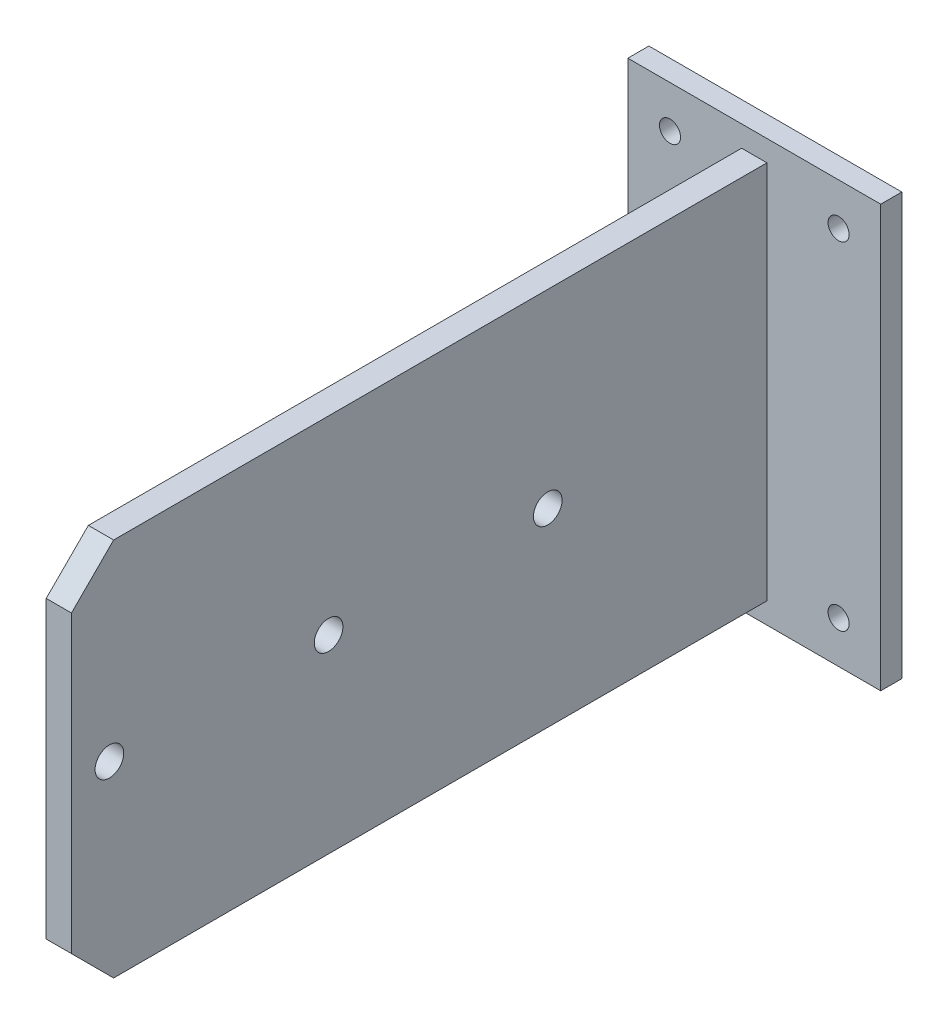
ISO-10303-21;
HEADER;
FILE_DESCRIPTION(('STEP AP214'),'2;1');
FILE_NAME('part.step','',(''),(''),'','','');
FILE_SCHEMA(('AUTOMOTIVE_DESIGN { 1 0 10303 214 1 1 1 1 }'));
ENDSEC;
DATA;
#1=APPLICATION_CONTEXT('core data for automotive mechanical design processes');
#2=APPLICATION_PROTOCOL_DEFINITION('international standard','automotive_design',2000,#1);
#3=PRODUCT_CONTEXT('',#1,'mechanical');
#4=PRODUCT('Part','Part','',(#3));
#5=PRODUCT_RELATED_PRODUCT_CATEGORY('part','',(#4));
#6=PRODUCT_DEFINITION_FORMATION('','',#4);
#7=PRODUCT_DEFINITION_CONTEXT('part definition',#1,'design');
#8=PRODUCT_DEFINITION('design','',#6,#7);
#9=PRODUCT_DEFINITION_SHAPE('','',#8);
#10=(LENGTH_UNIT() NAMED_UNIT(*) SI_UNIT(.MILLI.,.METRE.));
#11=(NAMED_UNIT(*) PLANE_ANGLE_UNIT() SI_UNIT($,.RADIAN.));
#12=(NAMED_UNIT(*) SI_UNIT($,.STERADIAN.) SOLID_ANGLE_UNIT());
#13=UNCERTAINTY_MEASURE_WITH_UNIT(LENGTH_MEASURE(1.E-05),#10,'distance_accuracy_value','');
#14=(GEOMETRIC_REPRESENTATION_CONTEXT(3) GLOBAL_UNCERTAINTY_ASSIGNED_CONTEXT((#13)) GLOBAL_UNIT_ASSIGNED_CONTEXT((#10,
#11,#12)) REPRESENTATION_CONTEXT('',''));
#15=CARTESIAN_POINT('',(0.,0.,0.));
#16=DIRECTION('',(0.,0.,1.));
#17=DIRECTION('',(1.,0.,0.));
#18=AXIS2_PLACEMENT_3D('',#15,#16,#17);
#19=CARTESIAN_POINT('',(0.,0.,5.));
#20=DIRECTION('',(0.,0.,-1.));
#21=DIRECTION('',(-1.,0.,0.));
#22=AXIS2_PLACEMENT_3D('',#19,#20,#21);
#23=PLANE('',#22);
#24=CARTESIAN_POINT('',(-20.,-40.,5.));
#25=DIRECTION('',(0.,0.,1.));
#26=DIRECTION('',(-1.,0.,0.));
#27=AXIS2_PLACEMENT_3D('',#24,#25,#26);
#28=CIRCLE('',#27,2.5);
#29=CARTESIAN_POINT('',(-22.5,-40.,5.));
#30=VERTEX_POINT('',#29);
#31=EDGE_CURVE('E155',#30,#30,#28,.T.);
#32=ORIENTED_EDGE('',*,*,#31,.F.);
#33=EDGE_LOOP('',(#32));
#34=FACE_BOUND('',#33,.T.);
#35=CARTESIAN_POINT('',(20.,-40.,5.));
#36=DIRECTION('',(0.,0.,1.));
#37=DIRECTION('',(1.,0.,0.));
#38=AXIS2_PLACEMENT_3D('',#35,#36,#37);
#39=CIRCLE('',#38,2.5);
#40=CARTESIAN_POINT('',(22.5,-40.,5.));
#41=VERTEX_POINT('',#40);
#42=EDGE_CURVE('E161',#41,#41,#39,.T.);
#43=ORIENTED_EDGE('',*,*,#42,.F.);
#44=EDGE_LOOP('',(#43));
#45=FACE_BOUND('',#44,.T.);
#46=CARTESIAN_POINT('',(20.,40.,5.));
#47=DIRECTION('',(0.,0.,1.));
#48=DIRECTION('',(-1.,0.,0.));
#49=AXIS2_PLACEMENT_3D('',#46,#47,#48);
#50=CIRCLE('',#49,2.5);
#51=CARTESIAN_POINT('',(17.5,40.,5.));
#52=VERTEX_POINT('',#51);
#53=EDGE_CURVE('E167',#52,#52,#50,.T.);
#54=ORIENTED_EDGE('',*,*,#53,.F.);
#55=EDGE_LOOP('',(#54));
#56=FACE_BOUND('',#55,.T.);
#57=CARTESIAN_POINT('',(-20.,40.,5.));
#58=DIRECTION('',(0.,0.,1.));
#59=DIRECTION('',(1.,0.,0.));
#60=AXIS2_PLACEMENT_3D('',#57,#58,#59);
#61=CIRCLE('',#60,2.5);
#62=CARTESIAN_POINT('',(-17.5,40.,5.));
#63=VERTEX_POINT('',#62);
#64=EDGE_CURVE('E173',#63,#63,#61,.T.);
#65=ORIENTED_EDGE('',*,*,#64,.F.);
#66=EDGE_LOOP('',(#65));
#67=FACE_BOUND('',#66,.T.);
#68=DIRECTION('',(0.,1.,0.));
#69=VECTOR('',#68,1.);
#70=CARTESIAN_POINT('',(30.,-50.,5.));
#71=LINE('',#70,#69);
#72=CARTESIAN_POINT('',(30.,-50.,5.));
#73=VERTEX_POINT('',#72);
#74=CARTESIAN_POINT('',(30.,50.,5.));
#75=VERTEX_POINT('',#74);
#76=EDGE_CURVE('E179',#73,#75,#71,.T.);
#77=ORIENTED_EDGE('',*,*,#76,.T.);
#78=DIRECTION('',(-1.,0.,0.));
#79=VECTOR('',#78,1.);
#80=CARTESIAN_POINT('',(-30.,50.,5.));
#81=LINE('',#80,#79);
#82=CARTESIAN_POINT('',(-30.,50.,5.));
#83=VERTEX_POINT('',#82);
#84=EDGE_CURVE('E182',#75,#83,#81,.T.);
#85=ORIENTED_EDGE('',*,*,#84,.T.);
#86=DIRECTION('',(0.,-1.,0.));
#87=VECTOR('',#86,1.);
#88=CARTESIAN_POINT('',(-30.,-50.,5.));
#89=LINE('',#88,#87);
#90=CARTESIAN_POINT('',(-30.,-50.,5.));
#91=VERTEX_POINT('',#90);
#92=EDGE_CURVE('E185',#83,#91,#89,.T.);
#93=ORIENTED_EDGE('',*,*,#92,.T.);
#94=DIRECTION('',(1.,0.,0.));
#95=VECTOR('',#94,1.);
#96=CARTESIAN_POINT('',(-30.,-50.,5.));
#97=LINE('',#96,#95);
#98=EDGE_CURVE('E187',#91,#73,#97,.T.);
#99=ORIENTED_EDGE('',*,*,#98,.T.);
#100=EDGE_LOOP('',(#77,#85,#93,#99));
#101=FACE_BOUND('',#100,.T.);
#102=DIRECTION('',(1.,0.,0.));
#103=VECTOR('',#102,1.);
#104=CARTESIAN_POINT('',(0.,-45.,5.));
#105=LINE('',#104,#103);
#106=CARTESIAN_POINT('',(-3.,-45.,5.));
#107=VERTEX_POINT('',#106);
#108=CARTESIAN_POINT('',(3.,-45.,5.));
#109=VERTEX_POINT('',#108);
#110=EDGE_CURVE('E133',#107,#109,#105,.T.);
#111=ORIENTED_EDGE('',*,*,#110,.F.);
#112=DIRECTION('',(0.,1.,0.));
#113=VECTOR('',#112,1.);
#114=CARTESIAN_POINT('',(-3.,0.,5.));
#115=LINE('',#114,#113);
#116=CARTESIAN_POINT('',(-3.,45.,5.));
#117=VERTEX_POINT('',#116);
#118=EDGE_CURVE('E144',#107,#117,#115,.T.);
#119=ORIENTED_EDGE('',*,*,#118,.T.);
#120=DIRECTION('',(1.,0.,0.));
#121=VECTOR('',#120,1.);
#122=CARTESIAN_POINT('',(0.,45.,5.));
#123=LINE('',#122,#121);
#124=CARTESIAN_POINT('',(3.,45.,5.));
#125=VERTEX_POINT('',#124);
#126=EDGE_CURVE('E142',#117,#125,#123,.T.);
#127=ORIENTED_EDGE('',*,*,#126,.T.);
#128=DIRECTION('',(0.,1.,0.));
#129=VECTOR('',#128,1.);
#130=CARTESIAN_POINT('',(3.,0.,5.));
#131=LINE('',#130,#129);
#132=EDGE_CURVE('E126',#109,#125,#131,.T.);
#133=ORIENTED_EDGE('',*,*,#132,.F.);
#134=EDGE_LOOP('',(#111,#119,#127,#133));
#135=FACE_BOUND('',#134,.T.);
#136=ADVANCED_FACE('F41',(#34,#45,#56,#67,#101,#135),#23,.F.);
#137=CARTESIAN_POINT('',(0.,0.,0.));
#138=DIRECTION('',(0.,0.,-1.));
#139=DIRECTION('',(-1.,0.,0.));
#140=AXIS2_PLACEMENT_3D('',#137,#138,#139);
#141=PLANE('',#140);
#142=CARTESIAN_POINT('',(20.,-40.,0.));
#143=DIRECTION('',(0.,0.,1.));
#144=DIRECTION('',(1.,0.,0.));
#145=AXIS2_PLACEMENT_3D('',#142,#143,#144);
#146=CIRCLE('',#145,2.5);
#147=CARTESIAN_POINT('',(22.5,-40.,0.));
#148=VERTEX_POINT('',#147);
#149=EDGE_CURVE('E158',#148,#148,#146,.T.);
#150=ORIENTED_EDGE('',*,*,#149,.T.);
#151=EDGE_LOOP('',(#150));
#152=FACE_BOUND('',#151,.T.);
#153=CARTESIAN_POINT('',(-20.,40.,0.));
#154=DIRECTION('',(0.,0.,1.));
#155=DIRECTION('',(1.,0.,0.));
#156=AXIS2_PLACEMENT_3D('',#153,#154,#155);
#157=CIRCLE('',#156,2.5);
#158=CARTESIAN_POINT('',(-17.5,40.,0.));
#159=VERTEX_POINT('',#158);
#160=EDGE_CURVE('E170',#159,#159,#157,.T.);
#161=ORIENTED_EDGE('',*,*,#160,.T.);
#162=EDGE_LOOP('',(#161));
#163=FACE_BOUND('',#162,.T.);
#164=DIRECTION('',(0.,1.,0.));
#165=VECTOR('',#164,1.);
#166=CARTESIAN_POINT('',(30.,-50.,0.));
#167=LINE('',#166,#165);
#168=CARTESIAN_POINT('',(30.,-50.,0.));
#169=VERTEX_POINT('',#168);
#170=CARTESIAN_POINT('',(30.,50.,0.));
#171=VERTEX_POINT('',#170);
#172=EDGE_CURVE('E176',#169,#171,#167,.T.);
#173=ORIENTED_EDGE('',*,*,#172,.F.);
#174=DIRECTION('',(1.,0.,0.));
#175=VECTOR('',#174,1.);
#176=CARTESIAN_POINT('',(-30.,-50.,0.));
#177=LINE('',#176,#175);
#178=CARTESIAN_POINT('',(-30.,-50.,0.));
#179=VERTEX_POINT('',#178);
#180=EDGE_CURVE('E183',#179,#169,#177,.T.);
#181=ORIENTED_EDGE('',*,*,#180,.F.);
#182=DIRECTION('',(0.,-1.,0.));
#183=VECTOR('',#182,1.);
#184=CARTESIAN_POINT('',(-30.,-50.,0.));
#185=LINE('',#184,#183);
#186=CARTESIAN_POINT('',(-30.,50.,0.));
#187=VERTEX_POINT('',#186);
#188=EDGE_CURVE('E194',#187,#179,#185,.T.);
#189=ORIENTED_EDGE('',*,*,#188,.F.);
#190=DIRECTION('',(-1.,0.,0.));
#191=VECTOR('',#190,1.);
#192=CARTESIAN_POINT('',(-30.,50.,0.));
#193=LINE('',#192,#191);
#194=EDGE_CURVE('E192',#171,#187,#193,.T.);
#195=ORIENTED_EDGE('',*,*,#194,.F.);
#196=EDGE_LOOP('',(#173,#181,#189,#195));
#197=FACE_BOUND('',#196,.T.);
#198=CARTESIAN_POINT('',(20.,40.,0.));
#199=DIRECTION('',(0.,0.,1.));
#200=DIRECTION('',(-1.,0.,0.));
#201=AXIS2_PLACEMENT_3D('',#198,#199,#200);
#202=CIRCLE('',#201,2.5);
#203=CARTESIAN_POINT('',(17.5,40.,0.));
#204=VERTEX_POINT('',#203);
#205=EDGE_CURVE('E164',#204,#204,#202,.T.);
#206=ORIENTED_EDGE('',*,*,#205,.T.);
#207=EDGE_LOOP('',(#206));
#208=FACE_BOUND('',#207,.T.);
#209=CARTESIAN_POINT('',(-20.,-40.,0.));
#210=DIRECTION('',(0.,0.,1.));
#211=DIRECTION('',(-1.,0.,0.));
#212=AXIS2_PLACEMENT_3D('',#209,#210,#211);
#213=CIRCLE('',#212,2.5);
#214=CARTESIAN_POINT('',(-22.5,-40.,0.));
#215=VERTEX_POINT('',#214);
#216=EDGE_CURVE('E129',#215,#215,#213,.T.);
#217=ORIENTED_EDGE('',*,*,#216,.T.);
#218=EDGE_LOOP('',(#217));
#219=FACE_BOUND('',#218,.T.);
#220=ADVANCED_FACE('F238',(#152,#163,#197,#208,#219),#141,.T.);
#221=CARTESIAN_POINT('',(30.,-50.,5.));
#222=DIRECTION('',(-1.,0.,0.));
#223=DIRECTION('',(0.,0.,1.));
#224=AXIS2_PLACEMENT_3D('',#221,#222,#223);
#225=PLANE('',#224);
#226=ORIENTED_EDGE('',*,*,#172,.T.);
#227=DIRECTION('',(0.,0.,-1.));
#228=VECTOR('',#227,1.);
#229=CARTESIAN_POINT('',(30.,50.,5.));
#230=LINE('',#229,#228);
#231=EDGE_CURVE('E205',#75,#171,#230,.T.);
#232=ORIENTED_EDGE('',*,*,#231,.F.);
#233=ORIENTED_EDGE('',*,*,#76,.F.);
#234=DIRECTION('',(0.,0.,-1.));
#235=VECTOR('',#234,1.);
#236=CARTESIAN_POINT('',(30.,-50.,5.));
#237=LINE('',#236,#235);
#238=EDGE_CURVE('E189',#73,#169,#237,.T.);
#239=ORIENTED_EDGE('',*,*,#238,.T.);
#240=EDGE_LOOP('',(#226,#232,#233,#239));
#241=FACE_BOUND('',#240,.T.);
#242=ADVANCED_FACE('F246',(#241),#225,.F.);
#243=CARTESIAN_POINT('',(-30.,50.,5.));
#244=DIRECTION('',(0.,-1.,0.));
#245=DIRECTION('',(0.,0.,-1.));
#246=AXIS2_PLACEMENT_3D('',#243,#244,#245);
#247=PLANE('',#246);
#248=ORIENTED_EDGE('',*,*,#194,.T.);
#249=DIRECTION('',(0.,0.,-1.));
#250=VECTOR('',#249,1.);
#251=CARTESIAN_POINT('',(-30.,50.,5.));
#252=LINE('',#251,#250);
#253=EDGE_CURVE('E202',#83,#187,#252,.T.);
#254=ORIENTED_EDGE('',*,*,#253,.F.);
#255=ORIENTED_EDGE('',*,*,#84,.F.);
#256=ORIENTED_EDGE('',*,*,#231,.T.);
#257=EDGE_LOOP('',(#248,#254,#255,#256));
#258=FACE_BOUND('',#257,.T.);
#259=ADVANCED_FACE('F262',(#258),#247,.F.);
#260=CARTESIAN_POINT('',(-30.,-50.,5.));
#261=DIRECTION('',(1.,0.,0.));
#262=DIRECTION('',(0.,0.,-1.));
#263=AXIS2_PLACEMENT_3D('',#260,#261,#262);
#264=PLANE('',#263);
#265=ORIENTED_EDGE('',*,*,#188,.T.);
#266=DIRECTION('',(0.,0.,-1.));
#267=VECTOR('',#266,1.);
#268=CARTESIAN_POINT('',(-30.,-50.,5.));
#269=LINE('',#268,#267);
#270=EDGE_CURVE('E199',#91,#179,#269,.T.);
#271=ORIENTED_EDGE('',*,*,#270,.F.);
#272=ORIENTED_EDGE('',*,*,#92,.F.);
#273=ORIENTED_EDGE('',*,*,#253,.T.);
#274=EDGE_LOOP('',(#265,#271,#272,#273));
#275=FACE_BOUND('',#274,.T.);
#276=ADVANCED_FACE('F258',(#275),#264,.F.);
#277=CARTESIAN_POINT('',(-30.,-50.,5.));
#278=DIRECTION('',(0.,1.,0.));
#279=DIRECTION('',(0.,0.,1.));
#280=AXIS2_PLACEMENT_3D('',#277,#278,#279);
#281=PLANE('',#280);
#282=ORIENTED_EDGE('',*,*,#180,.T.);
#283=ORIENTED_EDGE('',*,*,#238,.F.);
#284=ORIENTED_EDGE('',*,*,#98,.F.);
#285=ORIENTED_EDGE('',*,*,#270,.T.);
#286=EDGE_LOOP('',(#282,#283,#284,#285));
#287=FACE_BOUND('',#286,.T.);
#288=ADVANCED_FACE('F255',(#287),#281,.F.);
#289=CARTESIAN_POINT('',(-20.,40.,5.));
#290=DIRECTION('',(0.,0.,-1.));
#291=DIRECTION('',(-1.,0.,0.));
#292=AXIS2_PLACEMENT_3D('',#289,#290,#291);
#293=CYLINDRICAL_SURFACE('',#292,2.5);
#294=ORIENTED_EDGE('',*,*,#64,.T.);
#295=EDGE_LOOP('',(#294));
#296=FACE_BOUND('',#295,.T.);
#297=ORIENTED_EDGE('',*,*,#160,.F.);
#298=EDGE_LOOP('',(#297));
#299=FACE_BOUND('',#298,.T.);
#300=ADVANCED_FACE('F252',(#296,#299),#293,.F.);
#301=CARTESIAN_POINT('',(20.,40.,5.));
#302=DIRECTION('',(0.,0.,-1.));
#303=DIRECTION('',(-1.,0.,0.));
#304=AXIS2_PLACEMENT_3D('',#301,#302,#303);
#305=CYLINDRICAL_SURFACE('',#304,2.5);
#306=ORIENTED_EDGE('',*,*,#53,.T.);
#307=EDGE_LOOP('',(#306));
#308=FACE_BOUND('',#307,.T.);
#309=ORIENTED_EDGE('',*,*,#205,.F.);
#310=EDGE_LOOP('',(#309));
#311=FACE_BOUND('',#310,.T.);
#312=ADVANCED_FACE('F295',(#308,#311),#305,.F.);
#313=CARTESIAN_POINT('',(20.,-40.,5.));
#314=DIRECTION('',(0.,0.,-1.));
#315=DIRECTION('',(-1.,0.,0.));
#316=AXIS2_PLACEMENT_3D('',#313,#314,#315);
#317=CYLINDRICAL_SURFACE('',#316,2.5);
#318=ORIENTED_EDGE('',*,*,#42,.T.);
#319=EDGE_LOOP('',(#318));
#320=FACE_BOUND('',#319,.T.);
#321=ORIENTED_EDGE('',*,*,#149,.F.);
#322=EDGE_LOOP('',(#321));
#323=FACE_BOUND('',#322,.T.);
#324=ADVANCED_FACE('F288',(#320,#323),#317,.F.);
#325=CARTESIAN_POINT('',(-20.,-40.,5.));
#326=DIRECTION('',(0.,0.,-1.));
#327=DIRECTION('',(-1.,0.,0.));
#328=AXIS2_PLACEMENT_3D('',#325,#326,#327);
#329=CYLINDRICAL_SURFACE('',#328,2.5);
#330=ORIENTED_EDGE('',*,*,#31,.T.);
#331=EDGE_LOOP('',(#330));
#332=FACE_BOUND('',#331,.T.);
#333=ORIENTED_EDGE('',*,*,#216,.F.);
#334=EDGE_LOOP('',(#333));
#335=FACE_BOUND('',#334,.T.);
#336=ADVANCED_FACE('F287',(#332,#335),#329,.F.);
#337=CARTESIAN_POINT('',(0.,-45.,170.));
#338=DIRECTION('',(0.,1.,0.));
#339=DIRECTION('',(0.,0.,1.));
#340=AXIS2_PLACEMENT_3D('',#337,#338,#339);
#341=PLANE('',#340);
#342=DIRECTION('',(0.,0.,-1.));
#343=VECTOR('',#342,1.);
#344=CARTESIAN_POINT('',(3.,-45.,170.));
#345=LINE('',#344,#343);
#346=CARTESIAN_POINT('',(3.,-45.,160.));
#347=VERTEX_POINT('',#346);
#348=EDGE_CURVE('E120',#347,#109,#345,.T.);
#349=ORIENTED_EDGE('',*,*,#348,.F.);
#350=DIRECTION('',(-1.,0.,0.));
#351=VECTOR('',#350,1.);
#352=CARTESIAN_POINT('',(-3.,-45.,160.));
#353=LINE('',#352,#351);
#354=CARTESIAN_POINT('',(-3.,-45.,160.));
#355=VERTEX_POINT('',#354);
#356=EDGE_CURVE('E65',#347,#355,#353,.T.);
#357=ORIENTED_EDGE('',*,*,#356,.T.);
#358=DIRECTION('',(0.,0.,-1.));
#359=VECTOR('',#358,1.);
#360=CARTESIAN_POINT('',(-3.,-45.,170.));
#361=LINE('',#360,#359);
#362=EDGE_CURVE('E135',#355,#107,#361,.T.);
#363=ORIENTED_EDGE('',*,*,#362,.T.);
#364=ORIENTED_EDGE('',*,*,#110,.T.);
#365=EDGE_LOOP('',(#349,#357,#363,#364));
#366=FACE_BOUND('',#365,.T.);
#367=ADVANCED_FACE('F134',(#366),#341,.F.);
#368=CARTESIAN_POINT('',(3.,0.,170.));
#369=DIRECTION('',(-1.,0.,0.));
#370=DIRECTION('',(0.,0.,1.));
#371=AXIS2_PLACEMENT_3D('',#368,#369,#370);
#372=PLANE('',#371);
#373=CARTESIAN_POINT('',(3.,0.,57.));
#374=DIRECTION('',(-1.,0.,0.));
#375=DIRECTION('',(0.,0.,1.));
#376=AXIS2_PLACEMENT_3D('',#373,#374,#375);
#377=CIRCLE('',#376,3.4);
#378=CARTESIAN_POINT('',(3.,0.,60.4));
#379=VERTEX_POINT('',#378);
#380=EDGE_CURVE('E139',#379,#379,#377,.T.);
#381=ORIENTED_EDGE('',*,*,#380,.T.);
#382=EDGE_LOOP('',(#381));
#383=FACE_BOUND('',#382,.T.);
#384=CARTESIAN_POINT('',(3.,0.,109.));
#385=DIRECTION('',(-1.,0.,0.));
#386=DIRECTION('',(0.,0.,1.));
#387=AXIS2_PLACEMENT_3D('',#384,#385,#386);
#388=CIRCLE('',#387,3.4);
#389=CARTESIAN_POINT('',(3.,0.,112.4));
#390=VERTEX_POINT('',#389);
#391=EDGE_CURVE('E445',#390,#390,#388,.T.);
#392=ORIENTED_EDGE('',*,*,#391,.T.);
#393=EDGE_LOOP('',(#392));
#394=FACE_BOUND('',#393,.T.);
#395=CARTESIAN_POINT('',(3.,0.,161.));
#396=DIRECTION('',(-1.,0.,0.));
#397=DIRECTION('',(0.,0.,1.));
#398=AXIS2_PLACEMENT_3D('',#395,#396,#397);
#399=CIRCLE('',#398,3.4);
#400=CARTESIAN_POINT('',(3.,0.,164.4));
#401=VERTEX_POINT('',#400);
#402=EDGE_CURVE('E448',#401,#401,#399,.T.);
#403=ORIENTED_EDGE('',*,*,#402,.T.);
#404=EDGE_LOOP('',(#403));
#405=FACE_BOUND('',#404,.T.);
#406=DIRECTION('',(0.,1.,0.));
#407=VECTOR('',#406,1.);
#408=CARTESIAN_POINT('',(3.,0.,170.));
#409=LINE('',#408,#407);
#410=CARTESIAN_POINT('',(3.,-35.,170.));
#411=VERTEX_POINT('',#410);
#412=CARTESIAN_POINT('',(3.,35.,170.));
#413=VERTEX_POINT('',#412);
#414=EDGE_CURVE('E149',#411,#413,#409,.T.);
#415=ORIENTED_EDGE('',*,*,#414,.F.);
#416=DIRECTION('',(0.,-0.707106781186547,-0.707106781186549));
#417=VECTOR('',#416,1.);
#418=CARTESIAN_POINT('',(3.,-35.,170.));
#419=LINE('',#418,#417);
#420=EDGE_CURVE('E128',#411,#347,#419,.T.);
#421=ORIENTED_EDGE('',*,*,#420,.T.);
#422=ORIENTED_EDGE('',*,*,#348,.T.);
#423=ORIENTED_EDGE('',*,*,#132,.T.);
#424=DIRECTION('',(0.,0.,-1.));
#425=VECTOR('',#424,1.);
#426=CARTESIAN_POINT('',(3.,45.,170.));
#427=LINE('',#426,#425);
#428=CARTESIAN_POINT('',(3.,45.,160.));
#429=VERTEX_POINT('',#428);
#430=EDGE_CURVE('E130',#429,#125,#427,.T.);
#431=ORIENTED_EDGE('',*,*,#430,.F.);
#432=DIRECTION('',(0.,0.707106781186549,-0.707106781186547));
#433=VECTOR('',#432,1.);
#434=CARTESIAN_POINT('',(3.,45.,160.));
#435=LINE('',#434,#433);
#436=EDGE_CURVE('E213',#429,#413,#435,.F.);
#437=ORIENTED_EDGE('',*,*,#436,.T.);
#438=EDGE_LOOP('',(#415,#421,#422,#423,#431,#437));
#439=FACE_BOUND('',#438,.T.);
#440=ADVANCED_FACE('F123',(#383,#394,#405,#439),#372,.F.);
#441=CARTESIAN_POINT('',(0.,45.,170.));
#442=DIRECTION('',(0.,1.,0.));
#443=DIRECTION('',(0.,0.,1.));
#444=AXIS2_PLACEMENT_3D('',#441,#442,#443);
#445=PLANE('',#444);
#446=DIRECTION('',(0.,0.,-1.));
#447=VECTOR('',#446,1.);
#448=CARTESIAN_POINT('',(-3.,45.,170.));
#449=LINE('',#448,#447);
#450=CARTESIAN_POINT('',(-3.,45.,160.));
#451=VERTEX_POINT('',#450);
#452=EDGE_CURVE('E151',#451,#117,#449,.T.);
#453=ORIENTED_EDGE('',*,*,#452,.F.);
#454=DIRECTION('',(1.,0.,0.));
#455=VECTOR('',#454,1.);
#456=CARTESIAN_POINT('',(0.,45.,160.));
#457=LINE('',#456,#455);
#458=EDGE_CURVE('E11',#451,#429,#457,.T.);
#459=ORIENTED_EDGE('',*,*,#458,.T.);
#460=ORIENTED_EDGE('',*,*,#430,.T.);
#461=ORIENTED_EDGE('',*,*,#126,.F.);
#462=EDGE_LOOP('',(#453,#459,#460,#461));
#463=FACE_BOUND('',#462,.T.);
#464=ADVANCED_FACE('F374',(#463),#445,.T.);
#465=CARTESIAN_POINT('',(-3.,0.,170.));
#466=DIRECTION('',(-1.,0.,0.));
#467=DIRECTION('',(0.,0.,1.));
#468=AXIS2_PLACEMENT_3D('',#465,#466,#467);
#469=PLANE('',#468);
#470=CARTESIAN_POINT('',(-3.,0.,57.));
#471=DIRECTION('',(-1.,0.,0.));
#472=DIRECTION('',(0.,0.,1.));
#473=AXIS2_PLACEMENT_3D('',#470,#471,#472);
#474=CIRCLE('',#473,3.4);
#475=CARTESIAN_POINT('',(-3.,0.,60.4));
#476=VERTEX_POINT('',#475);
#477=EDGE_CURVE('E442',#476,#476,#474,.T.);
#478=ORIENTED_EDGE('',*,*,#477,.F.);
#479=EDGE_LOOP('',(#478));
#480=FACE_BOUND('',#479,.T.);
#481=CARTESIAN_POINT('',(-3.,0.,109.));
#482=DIRECTION('',(-1.,0.,0.));
#483=DIRECTION('',(0.,0.,1.));
#484=AXIS2_PLACEMENT_3D('',#481,#482,#483);
#485=CIRCLE('',#484,3.4);
#486=CARTESIAN_POINT('',(-3.,0.,112.4));
#487=VERTEX_POINT('',#486);
#488=EDGE_CURVE('E458',#487,#487,#485,.T.);
#489=ORIENTED_EDGE('',*,*,#488,.F.);
#490=EDGE_LOOP('',(#489));
#491=FACE_BOUND('',#490,.T.);
#492=CARTESIAN_POINT('',(-3.,0.,161.));
#493=DIRECTION('',(-1.,0.,0.));
#494=DIRECTION('',(0.,0.,1.));
#495=AXIS2_PLACEMENT_3D('',#492,#493,#494);
#496=CIRCLE('',#495,3.4);
#497=CARTESIAN_POINT('',(-3.,0.,164.4));
#498=VERTEX_POINT('',#497);
#499=EDGE_CURVE('E455',#498,#498,#496,.T.);
#500=ORIENTED_EDGE('',*,*,#499,.F.);
#501=EDGE_LOOP('',(#500));
#502=FACE_BOUND('',#501,.T.);
#503=ORIENTED_EDGE('',*,*,#362,.F.);
#504=DIRECTION('',(0.,0.707106781186547,0.707106781186549));
#505=VECTOR('',#504,1.);
#506=CARTESIAN_POINT('',(-3.,-17.5,187.5));
#507=LINE('',#506,#505);
#508=CARTESIAN_POINT('',(-3.,-35.,170.));
#509=VERTEX_POINT('',#508);
#510=EDGE_CURVE('E50',#355,#509,#507,.T.);
#511=ORIENTED_EDGE('',*,*,#510,.T.);
#512=DIRECTION('',(0.,1.,0.));
#513=VECTOR('',#512,1.);
#514=CARTESIAN_POINT('',(-3.,0.,170.));
#515=LINE('',#514,#513);
#516=CARTESIAN_POINT('',(-3.,35.,170.));
#517=VERTEX_POINT('',#516);
#518=EDGE_CURVE('E152',#509,#517,#515,.T.);
#519=ORIENTED_EDGE('',*,*,#518,.T.);
#520=DIRECTION('',(0.,-0.707106781186549,0.707106781186547));
#521=VECTOR('',#520,1.);
#522=CARTESIAN_POINT('',(-3.,17.4999999999999,187.5));
#523=LINE('',#522,#521);
#524=EDGE_CURVE('E57',#517,#451,#523,.F.);
#525=ORIENTED_EDGE('',*,*,#524,.T.);
#526=ORIENTED_EDGE('',*,*,#452,.T.);
#527=ORIENTED_EDGE('',*,*,#118,.F.);
#528=EDGE_LOOP('',(#503,#511,#519,#525,#526,#527));
#529=FACE_BOUND('',#528,.T.);
#530=ADVANCED_FACE('F219',(#480,#491,#502,#529),#469,.T.);
#531=CARTESIAN_POINT('',(0.,0.,170.));
#532=DIRECTION('',(0.,0.,1.));
#533=DIRECTION('',(1.,0.,0.));
#534=AXIS2_PLACEMENT_3D('',#531,#532,#533);
#535=PLANE('',#534);
#536=ORIENTED_EDGE('',*,*,#518,.F.);
#537=DIRECTION('',(1.,0.,0.));
#538=VECTOR('',#537,1.);
#539=CARTESIAN_POINT('',(3.,-35.,170.));
#540=LINE('',#539,#538);
#541=EDGE_CURVE('E210',#509,#411,#540,.T.);
#542=ORIENTED_EDGE('',*,*,#541,.T.);
#543=ORIENTED_EDGE('',*,*,#414,.T.);
#544=DIRECTION('',(-1.,0.,0.));
#545=VECTOR('',#544,1.);
#546=CARTESIAN_POINT('',(0.,35.,170.));
#547=LINE('',#546,#545);
#548=EDGE_CURVE('E208',#413,#517,#547,.T.);
#549=ORIENTED_EDGE('',*,*,#548,.T.);
#550=EDGE_LOOP('',(#536,#542,#543,#549));
#551=FACE_BOUND('',#550,.T.);
#552=ADVANCED_FACE('F223',(#551),#535,.T.);
#553=CARTESIAN_POINT('',(0.,-35.,170.));
#554=DIRECTION('',(0.,-0.707106781186549,0.707106781186547));
#555=DIRECTION('',(-1.,0.,0.));
#556=AXIS2_PLACEMENT_3D('',#553,#554,#555);
#557=PLANE('',#556);
#558=ORIENTED_EDGE('',*,*,#510,.F.);
#559=ORIENTED_EDGE('',*,*,#356,.F.);
#560=ORIENTED_EDGE('',*,*,#420,.F.);
#561=ORIENTED_EDGE('',*,*,#541,.F.);
#562=EDGE_LOOP('',(#558,#559,#560,#561));
#563=FACE_BOUND('',#562,.T.);
#564=ADVANCED_FACE('F226',(#563),#557,.T.);
#565=CARTESIAN_POINT('',(0.,45.,160.));
#566=DIRECTION('',(0.,-0.707106781186547,-0.707106781186549));
#567=DIRECTION('',(1.,0.,0.));
#568=AXIS2_PLACEMENT_3D('',#565,#566,#567);
#569=PLANE('',#568);
#570=ORIENTED_EDGE('',*,*,#524,.F.);
#571=ORIENTED_EDGE('',*,*,#548,.F.);
#572=ORIENTED_EDGE('',*,*,#436,.F.);
#573=ORIENTED_EDGE('',*,*,#458,.F.);
#574=EDGE_LOOP('',(#570,#571,#572,#573));
#575=FACE_BOUND('',#574,.T.);
#576=ADVANCED_FACE('F44',(#575),#569,.F.);
#577=CARTESIAN_POINT('',(162.,0.,161.));
#578=DIRECTION('',(-1.,0.,0.));
#579=DIRECTION('',(0.,0.,1.));
#580=AXIS2_PLACEMENT_3D('',#577,#578,#579);
#581=CYLINDRICAL_SURFACE('',#580,3.4);
#582=ORIENTED_EDGE('',*,*,#499,.T.);
#583=EDGE_LOOP('',(#582));
#584=FACE_BOUND('',#583,.T.);
#585=ORIENTED_EDGE('',*,*,#402,.F.);
#586=EDGE_LOOP('',(#585));
#587=FACE_BOUND('',#586,.T.);
#588=ADVANCED_FACE('F232',(#584,#587),#581,.F.);
#589=CARTESIAN_POINT('',(162.,0.,109.));
#590=DIRECTION('',(-1.,0.,0.));
#591=DIRECTION('',(0.,0.,1.));
#592=AXIS2_PLACEMENT_3D('',#589,#590,#591);
#593=CYLINDRICAL_SURFACE('',#592,3.4);
#594=ORIENTED_EDGE('',*,*,#488,.T.);
#595=EDGE_LOOP('',(#594));
#596=FACE_BOUND('',#595,.T.);
#597=ORIENTED_EDGE('',*,*,#391,.F.);
#598=EDGE_LOOP('',(#597));
#599=FACE_BOUND('',#598,.T.);
#600=ADVANCED_FACE('F412',(#596,#599),#593,.F.);
#601=CARTESIAN_POINT('',(162.,0.,57.));
#602=DIRECTION('',(-1.,0.,0.));
#603=DIRECTION('',(0.,0.,1.));
#604=AXIS2_PLACEMENT_3D('',#601,#602,#603);
#605=CYLINDRICAL_SURFACE('',#604,3.4);
#606=ORIENTED_EDGE('',*,*,#477,.T.);
#607=EDGE_LOOP('',(#606));
#608=FACE_BOUND('',#607,.T.);
#609=ORIENTED_EDGE('',*,*,#380,.F.);
#610=EDGE_LOOP('',(#609));
#611=FACE_BOUND('',#610,.T.);
#612=ADVANCED_FACE('F421',(#608,#611),#605,.F.);
#613=CLOSED_SHELL('',(#136,#220,#242,#259,#276,#288,#300,#312,#324,#336,#367,#440,#464,#530,
#552,#564,#576,#588,#600,#612));
#614=MANIFOLD_SOLID_BREP('B2',#613);
#615=ADVANCED_BREP_SHAPE_REPRESENTATION('',(#18,#614),#14);
#616=SHAPE_DEFINITION_REPRESENTATION(#9,#615);
ENDSEC;
END-ISO-10303-21;
